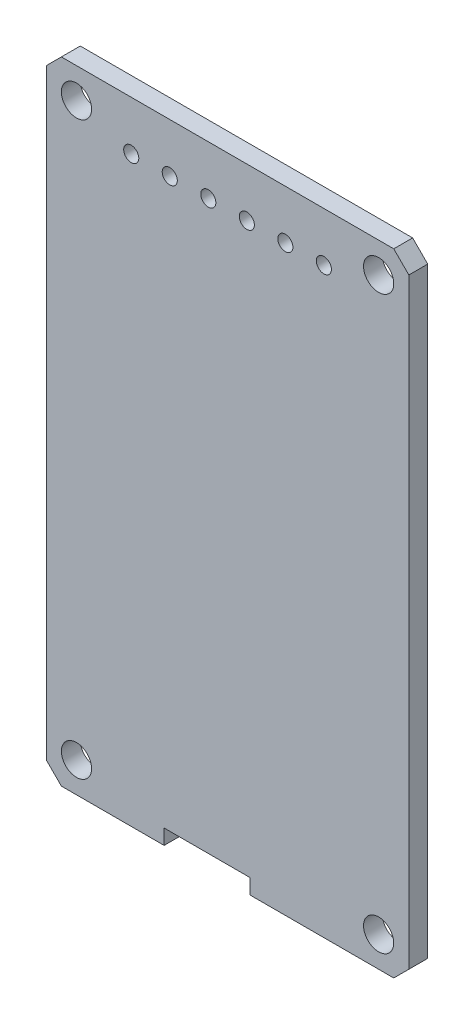
ISO-10303-21;
HEADER;
FILE_DESCRIPTION(('STEP AP214'),'2;1');
FILE_NAME('part.step','',(''),(''),'','','');
FILE_SCHEMA(('AUTOMOTIVE_DESIGN { 1 0 10303 214 1 1 1 1 }'));
ENDSEC;
DATA;
#1=APPLICATION_CONTEXT('core data for automotive mechanical design processes');
#2=APPLICATION_PROTOCOL_DEFINITION('international standard','automotive_design',2000,#1);
#3=PRODUCT_CONTEXT('',#1,'mechanical');
#4=PRODUCT('Part','Part','',(#3));
#5=PRODUCT_RELATED_PRODUCT_CATEGORY('part','',(#4));
#6=PRODUCT_DEFINITION_FORMATION('','',#4);
#7=PRODUCT_DEFINITION_CONTEXT('part definition',#1,'design');
#8=PRODUCT_DEFINITION('design','',#6,#7);
#9=PRODUCT_DEFINITION_SHAPE('','',#8);
#10=(LENGTH_UNIT() NAMED_UNIT(*) SI_UNIT(.MILLI.,.METRE.));
#11=(NAMED_UNIT(*) PLANE_ANGLE_UNIT() SI_UNIT($,.RADIAN.));
#12=(NAMED_UNIT(*) SI_UNIT($,.STERADIAN.) SOLID_ANGLE_UNIT());
#13=UNCERTAINTY_MEASURE_WITH_UNIT(LENGTH_MEASURE(1.E-05),#10,'distance_accuracy_value','');
#14=(GEOMETRIC_REPRESENTATION_CONTEXT(3) GLOBAL_UNCERTAINTY_ASSIGNED_CONTEXT((#13)) GLOBAL_UNIT_ASSIGNED_CONTEXT((#10,
#11,#12)) REPRESENTATION_CONTEXT('',''));
#15=CARTESIAN_POINT('',(0.,0.,0.));
#16=DIRECTION('',(0.,0.,1.));
#17=DIRECTION('',(1.,0.,0.));
#18=AXIS2_PLACEMENT_3D('',#15,#16,#17);
#19=CARTESIAN_POINT('',(0.,0.,0.));
#20=DIRECTION('',(0.,0.,1.));
#21=DIRECTION('',(1.,0.,0.));
#22=AXIS2_PLACEMENT_3D('',#19,#20,#21);
#23=PLANE('',#22);
#24=CARTESIAN_POINT('',(10.,2.,0.));
#25=DIRECTION('',(0.,0.,1.));
#26=DIRECTION('',(1.,0.,0.));
#27=AXIS2_PLACEMENT_3D('',#24,#25,#26);
#28=CIRCLE('',#27,1.);
#29=CARTESIAN_POINT('',(11.,2.,0.));
#30=VERTEX_POINT('',#29);
#31=EDGE_CURVE('E157',#30,#30,#28,.T.);
#32=ORIENTED_EDGE('',*,*,#31,.T.);
#33=EDGE_LOOP('',(#32));
#34=FACE_BOUND('',#33,.T.);
#35=CARTESIAN_POINT('',(1.275,38.55,0.));
#36=DIRECTION('',(0.,0.,1.));
#37=DIRECTION('',(1.,0.,0.));
#38=AXIS2_PLACEMENT_3D('',#35,#36,#37);
#39=CIRCLE('',#38,0.5);
#40=CARTESIAN_POINT('',(1.775,38.55,0.));
#41=VERTEX_POINT('',#40);
#42=EDGE_CURVE('E161',#41,#41,#39,.T.);
#43=ORIENTED_EDGE('',*,*,#42,.T.);
#44=EDGE_LOOP('',(#43));
#45=FACE_BOUND('',#44,.T.);
#46=CARTESIAN_POINT('',(-1.275,38.55,0.));
#47=DIRECTION('',(0.,0.,-1.));
#48=DIRECTION('',(-1.,0.,0.));
#49=AXIS2_PLACEMENT_3D('',#46,#47,#48);
#50=CIRCLE('',#49,0.5);
#51=CARTESIAN_POINT('',(-1.775,38.55,0.));
#52=VERTEX_POINT('',#51);
#53=EDGE_CURVE('E164',#52,#52,#50,.F.);
#54=ORIENTED_EDGE('',*,*,#53,.T.);
#55=EDGE_LOOP('',(#54));
#56=FACE_BOUND('',#55,.T.);
#57=CARTESIAN_POINT('',(-10.,2.,0.));
#58=DIRECTION('',(0.,0.,-1.));
#59=DIRECTION('',(-1.,0.,0.));
#60=AXIS2_PLACEMENT_3D('',#57,#58,#59);
#61=CIRCLE('',#60,1.);
#62=CARTESIAN_POINT('',(-11.,2.,0.));
#63=VERTEX_POINT('',#62);
#64=EDGE_CURVE('E167',#63,#63,#61,.F.);
#65=ORIENTED_EDGE('',*,*,#64,.T.);
#66=EDGE_LOOP('',(#65));
#67=FACE_BOUND('',#66,.T.);
#68=CARTESIAN_POINT('',(-10.,39.8,0.));
#69=DIRECTION('',(0.,0.,-1.));
#70=DIRECTION('',(-1.,0.,0.));
#71=AXIS2_PLACEMENT_3D('',#68,#69,#70);
#72=CIRCLE('',#71,1.);
#73=CARTESIAN_POINT('',(-11.,39.8,0.));
#74=VERTEX_POINT('',#73);
#75=EDGE_CURVE('E170',#74,#74,#72,.F.);
#76=ORIENTED_EDGE('',*,*,#75,.T.);
#77=EDGE_LOOP('',(#76));
#78=FACE_BOUND('',#77,.T.);
#79=CARTESIAN_POINT('',(-3.825,38.55,0.));
#80=DIRECTION('',(0.,0.,-1.));
#81=DIRECTION('',(-1.,0.,0.));
#82=AXIS2_PLACEMENT_3D('',#79,#80,#81);
#83=CIRCLE('',#82,0.5);
#84=CARTESIAN_POINT('',(-4.325,38.55,0.));
#85=VERTEX_POINT('',#84);
#86=EDGE_CURVE('E173',#85,#85,#83,.F.);
#87=ORIENTED_EDGE('',*,*,#86,.T.);
#88=EDGE_LOOP('',(#87));
#89=FACE_BOUND('',#88,.T.);
#90=CARTESIAN_POINT('',(-6.375,38.55,0.));
#91=DIRECTION('',(0.,0.,-1.));
#92=DIRECTION('',(-1.,0.,0.));
#93=AXIS2_PLACEMENT_3D('',#90,#91,#92);
#94=CIRCLE('',#93,0.5);
#95=CARTESIAN_POINT('',(-6.875,38.55,0.));
#96=VERTEX_POINT('',#95);
#97=EDGE_CURVE('E176',#96,#96,#94,.F.);
#98=ORIENTED_EDGE('',*,*,#97,.T.);
#99=EDGE_LOOP('',(#98));
#100=FACE_BOUND('',#99,.T.);
#101=CARTESIAN_POINT('',(3.825,38.55,0.));
#102=DIRECTION('',(0.,0.,1.));
#103=DIRECTION('',(1.,0.,0.));
#104=AXIS2_PLACEMENT_3D('',#101,#102,#103);
#105=CIRCLE('',#104,0.5);
#106=CARTESIAN_POINT('',(4.325,38.55,0.));
#107=VERTEX_POINT('',#106);
#108=EDGE_CURVE('E179',#107,#107,#105,.T.);
#109=ORIENTED_EDGE('',*,*,#108,.T.);
#110=EDGE_LOOP('',(#109));
#111=FACE_BOUND('',#110,.T.);
#112=CARTESIAN_POINT('',(10.,39.8,0.));
#113=DIRECTION('',(0.,0.,1.));
#114=DIRECTION('',(1.,0.,0.));
#115=AXIS2_PLACEMENT_3D('',#112,#113,#114);
#116=CIRCLE('',#115,1.);
#117=CARTESIAN_POINT('',(11.,39.8,0.));
#118=VERTEX_POINT('',#117);
#119=EDGE_CURVE('E181',#118,#118,#116,.T.);
#120=ORIENTED_EDGE('',*,*,#119,.T.);
#121=EDGE_LOOP('',(#120));
#122=FACE_BOUND('',#121,.T.);
#123=CARTESIAN_POINT('',(6.375,38.55,0.));
#124=DIRECTION('',(0.,0.,1.));
#125=DIRECTION('',(1.,0.,0.));
#126=AXIS2_PLACEMENT_3D('',#123,#124,#125);
#127=CIRCLE('',#126,0.5);
#128=CARTESIAN_POINT('',(6.875,38.55,0.));
#129=VERTEX_POINT('',#128);
#130=EDGE_CURVE('E20',#129,#129,#127,.T.);
#131=ORIENTED_EDGE('',*,*,#130,.T.);
#132=EDGE_LOOP('',(#131));
#133=FACE_BOUND('',#132,.T.);
#134=DIRECTION('',(1.,0.,0.));
#135=VECTOR('',#134,1.);
#136=CARTESIAN_POINT('',(1.5,1.,0.));
#137=LINE('',#136,#135);
#138=CARTESIAN_POINT('',(-4.2,1.,0.));
#139=VERTEX_POINT('',#138);
#140=CARTESIAN_POINT('',(1.5,1.,0.));
#141=VERTEX_POINT('',#140);
#142=EDGE_CURVE('E196',#139,#141,#137,.T.);
#143=ORIENTED_EDGE('',*,*,#142,.F.);
#144=DIRECTION('',(0.,1.,0.));
#145=VECTOR('',#144,1.);
#146=CARTESIAN_POINT('',(-4.2,1.,0.));
#147=LINE('',#146,#145);
#148=CARTESIAN_POINT('',(-4.2,0.,0.));
#149=VERTEX_POINT('',#148);
#150=EDGE_CURVE('E201',#149,#139,#147,.T.);
#151=ORIENTED_EDGE('',*,*,#150,.F.);
#152=DIRECTION('',(1.,0.,0.));
#153=VECTOR('',#152,1.);
#154=CARTESIAN_POINT('',(0.,0.,0.));
#155=LINE('',#154,#153);
#156=CARTESIAN_POINT('',(-11.,0.,0.));
#157=VERTEX_POINT('',#156);
#158=EDGE_CURVE('E208',#149,#157,#155,.F.);
#159=ORIENTED_EDGE('',*,*,#158,.T.);
#160=DIRECTION('',(-0.707106781186548,0.707106781186548,0.));
#161=VECTOR('',#160,1.);
#162=CARTESIAN_POINT('',(-12.,1.,0.));
#163=LINE('',#162,#161);
#164=CARTESIAN_POINT('',(-12.,1.,0.));
#165=VERTEX_POINT('',#164);
#166=EDGE_CURVE('E212',#157,#165,#163,.T.);
#167=ORIENTED_EDGE('',*,*,#166,.T.);
#168=DIRECTION('',(0.,1.,0.));
#169=VECTOR('',#168,1.);
#170=CARTESIAN_POINT('',(-12.,0.,0.));
#171=LINE('',#170,#169);
#172=CARTESIAN_POINT('',(-12.,40.8,0.));
#173=VERTEX_POINT('',#172);
#174=EDGE_CURVE('E216',#165,#173,#171,.T.);
#175=ORIENTED_EDGE('',*,*,#174,.T.);
#176=DIRECTION('',(-0.707106781186548,-0.707106781186548,0.));
#177=VECTOR('',#176,1.);
#178=CARTESIAN_POINT('',(-12.,40.8,0.));
#179=LINE('',#178,#177);
#180=CARTESIAN_POINT('',(-11.,41.8,0.));
#181=VERTEX_POINT('',#180);
#182=EDGE_CURVE('E218',#181,#173,#179,.T.);
#183=ORIENTED_EDGE('',*,*,#182,.F.);
#184=DIRECTION('',(1.,0.,0.));
#185=VECTOR('',#184,1.);
#186=CARTESIAN_POINT('',(-12.,41.8,0.));
#187=LINE('',#186,#185);
#188=CARTESIAN_POINT('',(11.,41.8,0.));
#189=VERTEX_POINT('',#188);
#190=EDGE_CURVE('E226',#181,#189,#187,.T.);
#191=ORIENTED_EDGE('',*,*,#190,.T.);
#192=DIRECTION('',(0.707106781186548,-0.707106781186548,0.));
#193=VECTOR('',#192,1.);
#194=CARTESIAN_POINT('',(12.,40.8,0.));
#195=LINE('',#194,#193);
#196=CARTESIAN_POINT('',(12.,40.8,0.));
#197=VERTEX_POINT('',#196);
#198=EDGE_CURVE('E230',#189,#197,#195,.T.);
#199=ORIENTED_EDGE('',*,*,#198,.T.);
#200=DIRECTION('',(0.,1.,0.));
#201=VECTOR('',#200,1.);
#202=CARTESIAN_POINT('',(12.,0.,0.));
#203=LINE('',#202,#201);
#204=CARTESIAN_POINT('',(12.,1.,0.));
#205=VERTEX_POINT('',#204);
#206=EDGE_CURVE('E103',#205,#197,#203,.T.);
#207=ORIENTED_EDGE('',*,*,#206,.F.);
#208=DIRECTION('',(0.707106781186548,0.707106781186548,0.));
#209=VECTOR('',#208,1.);
#210=CARTESIAN_POINT('',(12.,1.,0.));
#211=LINE('',#210,#209);
#212=CARTESIAN_POINT('',(11.,0.,0.));
#213=VERTEX_POINT('',#212);
#214=EDGE_CURVE('E118',#213,#205,#211,.T.);
#215=ORIENTED_EDGE('',*,*,#214,.F.);
#216=DIRECTION('',(1.,0.,0.));
#217=VECTOR('',#216,1.);
#218=CARTESIAN_POINT('',(0.,0.,0.));
#219=LINE('',#218,#217);
#220=CARTESIAN_POINT('',(1.5,0.,0.));
#221=VERTEX_POINT('',#220);
#222=EDGE_CURVE('E108',#213,#221,#219,.F.);
#223=ORIENTED_EDGE('',*,*,#222,.T.);
#224=DIRECTION('',(0.,1.,0.));
#225=VECTOR('',#224,1.);
#226=CARTESIAN_POINT('',(1.5,0.,0.));
#227=LINE('',#226,#225);
#228=EDGE_CURVE('E186',#141,#221,#227,.F.);
#229=ORIENTED_EDGE('',*,*,#228,.F.);
#230=EDGE_LOOP('',(#143,#151,#159,#167,#175,#183,#191,#199,#207,#215,#223,#229));
#231=FACE_BOUND('',#230,.T.);
#232=ADVANCED_FACE('F17',(#34,#45,#56,#67,#78,#89,#100,#111,#122,#133,#231),#23,.F.);
#233=CARTESIAN_POINT('',(0.,0.,0.));
#234=DIRECTION('',(0.,1.,0.));
#235=DIRECTION('',(0.,0.,1.));
#236=AXIS2_PLACEMENT_3D('',#233,#234,#235);
#237=PLANE('',#236);
#238=ORIENTED_EDGE('',*,*,#222,.F.);
#239=DIRECTION('',(0.,0.,1.));
#240=VECTOR('',#239,1.);
#241=CARTESIAN_POINT('',(11.,0.,-0.25));
#242=LINE('',#241,#240);
#243=CARTESIAN_POINT('',(11.,0.,1.25));
#244=VERTEX_POINT('',#243);
#245=EDGE_CURVE('E111',#244,#213,#242,.F.);
#246=ORIENTED_EDGE('',*,*,#245,.F.);
#247=DIRECTION('',(1.,0.,0.));
#248=VECTOR('',#247,1.);
#249=CARTESIAN_POINT('',(0.,0.,1.25));
#250=LINE('',#249,#248);
#251=CARTESIAN_POINT('',(1.5,0.,1.25));
#252=VERTEX_POINT('',#251);
#253=EDGE_CURVE('E160',#252,#244,#250,.T.);
#254=ORIENTED_EDGE('',*,*,#253,.F.);
#255=DIRECTION('',(0.,0.,1.));
#256=VECTOR('',#255,1.);
#257=CARTESIAN_POINT('',(1.5,0.,1.25));
#258=LINE('',#257,#256);
#259=EDGE_CURVE('E114',#221,#252,#258,.T.);
#260=ORIENTED_EDGE('',*,*,#259,.F.);
#261=EDGE_LOOP('',(#238,#246,#254,#260));
#262=FACE_BOUND('',#261,.T.);
#263=ADVANCED_FACE('F109',(#262),#237,.F.);
#264=CARTESIAN_POINT('',(12.,1.,-0.25));
#265=DIRECTION('',(0.707106781186548,-0.707106781186548,0.));
#266=DIRECTION('',(0.707106781186548,0.707106781186548,0.));
#267=AXIS2_PLACEMENT_3D('',#264,#265,#266);
#268=PLANE('',#267);
#269=ORIENTED_EDGE('',*,*,#214,.T.);
#270=DIRECTION('',(0.,0.,-1.));
#271=VECTOR('',#270,1.);
#272=CARTESIAN_POINT('',(12.,1.,0.));
#273=LINE('',#272,#271);
#274=CARTESIAN_POINT('',(12.,1.,1.25));
#275=VERTEX_POINT('',#274);
#276=EDGE_CURVE('E232',#275,#205,#273,.T.);
#277=ORIENTED_EDGE('',*,*,#276,.F.);
#278=DIRECTION('',(0.707106781186548,0.707106781186547,0.));
#279=VECTOR('',#278,1.);
#280=CARTESIAN_POINT('',(11.,0.,1.25));
#281=LINE('',#280,#279);
#282=EDGE_CURVE('E125',#244,#275,#281,.T.);
#283=ORIENTED_EDGE('',*,*,#282,.F.);
#284=ORIENTED_EDGE('',*,*,#245,.T.);
#285=EDGE_LOOP('',(#269,#277,#283,#284));
#286=FACE_BOUND('',#285,.T.);
#287=ADVANCED_FACE('F123',(#286),#268,.T.);
#288=CARTESIAN_POINT('',(12.,0.,0.));
#289=DIRECTION('',(1.,0.,0.));
#290=DIRECTION('',(0.,0.,-1.));
#291=AXIS2_PLACEMENT_3D('',#288,#289,#290);
#292=PLANE('',#291);
#293=DIRECTION('',(0.,1.,0.));
#294=VECTOR('',#293,1.);
#295=CARTESIAN_POINT('',(12.,0.,1.25));
#296=LINE('',#295,#294);
#297=CARTESIAN_POINT('',(12.,40.8,1.25));
#298=VERTEX_POINT('',#297);
#299=EDGE_CURVE('E249',#275,#298,#296,.T.);
#300=ORIENTED_EDGE('',*,*,#299,.F.);
#301=ORIENTED_EDGE('',*,*,#276,.T.);
#302=ORIENTED_EDGE('',*,*,#206,.T.);
#303=DIRECTION('',(0.,0.,1.));
#304=VECTOR('',#303,1.);
#305=CARTESIAN_POINT('',(12.,40.8,-0.25));
#306=LINE('',#305,#304);
#307=EDGE_CURVE('E228',#197,#298,#306,.T.);
#308=ORIENTED_EDGE('',*,*,#307,.T.);
#309=EDGE_LOOP('',(#300,#301,#302,#308));
#310=FACE_BOUND('',#309,.T.);
#311=ADVANCED_FACE('F236',(#310),#292,.T.);
#312=CARTESIAN_POINT('',(12.,40.8,-0.25));
#313=DIRECTION('',(-0.707106781186548,-0.707106781186548,0.));
#314=DIRECTION('',(0.707106781186548,-0.707106781186548,0.));
#315=AXIS2_PLACEMENT_3D('',#312,#313,#314);
#316=PLANE('',#315);
#317=ORIENTED_EDGE('',*,*,#198,.F.);
#318=DIRECTION('',(0.,0.,-1.));
#319=VECTOR('',#318,1.);
#320=CARTESIAN_POINT('',(11.,41.8,0.));
#321=LINE('',#320,#319);
#322=CARTESIAN_POINT('',(11.,41.8,1.25));
#323=VERTEX_POINT('',#322);
#324=EDGE_CURVE('E224',#189,#323,#321,.F.);
#325=ORIENTED_EDGE('',*,*,#324,.T.);
#326=DIRECTION('',(-0.707106781186547,0.707106781186547,0.));
#327=VECTOR('',#326,1.);
#328=CARTESIAN_POINT('',(12.,40.8,1.25));
#329=LINE('',#328,#327);
#330=EDGE_CURVE('E243',#298,#323,#329,.T.);
#331=ORIENTED_EDGE('',*,*,#330,.F.);
#332=ORIENTED_EDGE('',*,*,#307,.F.);
#333=EDGE_LOOP('',(#317,#325,#331,#332));
#334=FACE_BOUND('',#333,.T.);
#335=ADVANCED_FACE('F240',(#334),#316,.F.);
#336=CARTESIAN_POINT('',(-12.,41.8,0.));
#337=DIRECTION('',(0.,-1.,0.));
#338=DIRECTION('',(0.,0.,-1.));
#339=AXIS2_PLACEMENT_3D('',#336,#337,#338);
#340=PLANE('',#339);
#341=DIRECTION('',(1.,0.,0.));
#342=VECTOR('',#341,1.);
#343=CARTESIAN_POINT('',(0.,41.8,1.25));
#344=LINE('',#343,#342);
#345=CARTESIAN_POINT('',(-11.,41.8,1.25));
#346=VERTEX_POINT('',#345);
#347=EDGE_CURVE('E248',#323,#346,#344,.F.);
#348=ORIENTED_EDGE('',*,*,#347,.F.);
#349=ORIENTED_EDGE('',*,*,#324,.F.);
#350=ORIENTED_EDGE('',*,*,#190,.F.);
#351=DIRECTION('',(0.,0.,1.));
#352=VECTOR('',#351,1.);
#353=CARTESIAN_POINT('',(-11.,41.8,-0.25));
#354=LINE('',#353,#352);
#355=EDGE_CURVE('E221',#346,#181,#354,.F.);
#356=ORIENTED_EDGE('',*,*,#355,.F.);
#357=EDGE_LOOP('',(#348,#349,#350,#356));
#358=FACE_BOUND('',#357,.T.);
#359=ADVANCED_FACE('F426',(#358),#340,.F.);
#360=CARTESIAN_POINT('',(-12.,40.8,-0.25));
#361=DIRECTION('',(-0.707106781186548,0.707106781186548,0.));
#362=DIRECTION('',(-0.707106781186548,-0.707106781186548,0.));
#363=AXIS2_PLACEMENT_3D('',#360,#361,#362);
#364=PLANE('',#363);
#365=ORIENTED_EDGE('',*,*,#182,.T.);
#366=DIRECTION('',(0.,0.,-1.));
#367=VECTOR('',#366,1.);
#368=CARTESIAN_POINT('',(-12.,40.8,0.));
#369=LINE('',#368,#367);
#370=CARTESIAN_POINT('',(-12.,40.8,1.25));
#371=VERTEX_POINT('',#370);
#372=EDGE_CURVE('E214',#173,#371,#369,.F.);
#373=ORIENTED_EDGE('',*,*,#372,.T.);
#374=DIRECTION('',(-0.707106781186547,-0.707106781186547,0.));
#375=VECTOR('',#374,1.);
#376=CARTESIAN_POINT('',(-11.,41.8,1.25));
#377=LINE('',#376,#375);
#378=EDGE_CURVE('E256',#346,#371,#377,.T.);
#379=ORIENTED_EDGE('',*,*,#378,.F.);
#380=ORIENTED_EDGE('',*,*,#355,.T.);
#381=EDGE_LOOP('',(#365,#373,#379,#380));
#382=FACE_BOUND('',#381,.T.);
#383=ADVANCED_FACE('F418',(#382),#364,.T.);
#384=CARTESIAN_POINT('',(-12.,0.,0.));
#385=DIRECTION('',(1.,0.,0.));
#386=DIRECTION('',(0.,0.,-1.));
#387=AXIS2_PLACEMENT_3D('',#384,#385,#386);
#388=PLANE('',#387);
#389=DIRECTION('',(0.,1.,0.));
#390=VECTOR('',#389,1.);
#391=CARTESIAN_POINT('',(-12.,0.,1.25));
#392=LINE('',#391,#390);
#393=CARTESIAN_POINT('',(-12.,1.,1.25));
#394=VERTEX_POINT('',#393);
#395=EDGE_CURVE('E259',#371,#394,#392,.F.);
#396=ORIENTED_EDGE('',*,*,#395,.F.);
#397=ORIENTED_EDGE('',*,*,#372,.F.);
#398=ORIENTED_EDGE('',*,*,#174,.F.);
#399=DIRECTION('',(0.,0.,1.));
#400=VECTOR('',#399,1.);
#401=CARTESIAN_POINT('',(-12.,1.,-0.25));
#402=LINE('',#401,#400);
#403=EDGE_CURVE('E210',#165,#394,#402,.T.);
#404=ORIENTED_EDGE('',*,*,#403,.T.);
#405=EDGE_LOOP('',(#396,#397,#398,#404));
#406=FACE_BOUND('',#405,.T.);
#407=ADVANCED_FACE('F410',(#406),#388,.F.);
#408=CARTESIAN_POINT('',(-12.,1.,-0.25));
#409=DIRECTION('',(0.707106781186548,0.707106781186548,0.));
#410=DIRECTION('',(-0.707106781186548,0.707106781186548,0.));
#411=AXIS2_PLACEMENT_3D('',#408,#409,#410);
#412=PLANE('',#411);
#413=ORIENTED_EDGE('',*,*,#166,.F.);
#414=DIRECTION('',(0.,0.,1.));
#415=VECTOR('',#414,1.);
#416=CARTESIAN_POINT('',(-11.,0.,0.));
#417=LINE('',#416,#415);
#418=CARTESIAN_POINT('',(-11.,0.,1.25));
#419=VERTEX_POINT('',#418);
#420=EDGE_CURVE('E206',#157,#419,#417,.T.);
#421=ORIENTED_EDGE('',*,*,#420,.T.);
#422=DIRECTION('',(0.707106781186548,-0.707106781186547,0.));
#423=VECTOR('',#422,1.);
#424=CARTESIAN_POINT('',(-12.,1.,1.25));
#425=LINE('',#424,#423);
#426=EDGE_CURVE('E262',#394,#419,#425,.T.);
#427=ORIENTED_EDGE('',*,*,#426,.F.);
#428=ORIENTED_EDGE('',*,*,#403,.F.);
#429=EDGE_LOOP('',(#413,#421,#427,#428));
#430=FACE_BOUND('',#429,.T.);
#431=ADVANCED_FACE('F402',(#430),#412,.F.);
#432=CARTESIAN_POINT('',(0.,0.,0.));
#433=DIRECTION('',(0.,1.,0.));
#434=DIRECTION('',(0.,0.,1.));
#435=AXIS2_PLACEMENT_3D('',#432,#433,#434);
#436=PLANE('',#435);
#437=DIRECTION('',(1.,0.,0.));
#438=VECTOR('',#437,1.);
#439=CARTESIAN_POINT('',(0.,0.,1.25));
#440=LINE('',#439,#438);
#441=CARTESIAN_POINT('',(-4.2,0.,1.25));
#442=VERTEX_POINT('',#441);
#443=EDGE_CURVE('E265',#419,#442,#440,.T.);
#444=ORIENTED_EDGE('',*,*,#443,.F.);
#445=ORIENTED_EDGE('',*,*,#420,.F.);
#446=ORIENTED_EDGE('',*,*,#158,.F.);
#447=DIRECTION('',(0.,0.,-1.));
#448=VECTOR('',#447,1.);
#449=CARTESIAN_POINT('',(-4.2,0.,1.25));
#450=LINE('',#449,#448);
#451=EDGE_CURVE('E203',#442,#149,#450,.T.);
#452=ORIENTED_EDGE('',*,*,#451,.F.);
#453=EDGE_LOOP('',(#444,#445,#446,#452));
#454=FACE_BOUND('',#453,.T.);
#455=ADVANCED_FACE('F394',(#454),#436,.F.);
#456=CARTESIAN_POINT('',(-4.2,1.,1.25));
#457=DIRECTION('',(1.,0.,0.));
#458=DIRECTION('',(0.,0.,-1.));
#459=AXIS2_PLACEMENT_3D('',#456,#457,#458);
#460=PLANE('',#459);
#461=ORIENTED_EDGE('',*,*,#451,.T.);
#462=ORIENTED_EDGE('',*,*,#150,.T.);
#463=DIRECTION('',(0.,0.,-1.));
#464=VECTOR('',#463,1.);
#465=CARTESIAN_POINT('',(-4.2,1.,1.25));
#466=LINE('',#465,#464);
#467=CARTESIAN_POINT('',(-4.2,1.,1.25));
#468=VERTEX_POINT('',#467);
#469=EDGE_CURVE('E198',#468,#139,#466,.T.);
#470=ORIENTED_EDGE('',*,*,#469,.F.);
#471=DIRECTION('',(0.,1.,0.));
#472=VECTOR('',#471,1.);
#473=CARTESIAN_POINT('',(-4.2,0.,1.25));
#474=LINE('',#473,#472);
#475=EDGE_CURVE('E268',#442,#468,#474,.T.);
#476=ORIENTED_EDGE('',*,*,#475,.F.);
#477=EDGE_LOOP('',(#461,#462,#470,#476));
#478=FACE_BOUND('',#477,.T.);
#479=ADVANCED_FACE('F287',(#478),#460,.T.);
#480=CARTESIAN_POINT('',(1.5,1.,1.25));
#481=DIRECTION('',(0.,-1.,0.));
#482=DIRECTION('',(0.,0.,-1.));
#483=AXIS2_PLACEMENT_3D('',#480,#481,#482);
#484=PLANE('',#483);
#485=ORIENTED_EDGE('',*,*,#469,.T.);
#486=ORIENTED_EDGE('',*,*,#142,.T.);
#487=DIRECTION('',(0.,0.,1.));
#488=VECTOR('',#487,1.);
#489=CARTESIAN_POINT('',(1.5,1.,1.25));
#490=LINE('',#489,#488);
#491=CARTESIAN_POINT('',(1.5,1.,1.25));
#492=VERTEX_POINT('',#491);
#493=EDGE_CURVE('E35',#492,#141,#490,.F.);
#494=ORIENTED_EDGE('',*,*,#493,.F.);
#495=DIRECTION('',(1.,0.,0.));
#496=VECTOR('',#495,1.);
#497=CARTESIAN_POINT('',(0.,1.,1.25));
#498=LINE('',#497,#496);
#499=EDGE_CURVE('E271',#468,#492,#498,.T.);
#500=ORIENTED_EDGE('',*,*,#499,.F.);
#501=EDGE_LOOP('',(#485,#486,#494,#500));
#502=FACE_BOUND('',#501,.T.);
#503=ADVANCED_FACE('F277',(#502),#484,.T.);
#504=CARTESIAN_POINT('',(1.5,0.,1.25));
#505=DIRECTION('',(-1.,0.,0.));
#506=DIRECTION('',(0.,0.,1.));
#507=AXIS2_PLACEMENT_3D('',#504,#505,#506);
#508=PLANE('',#507);
#509=ORIENTED_EDGE('',*,*,#493,.T.);
#510=ORIENTED_EDGE('',*,*,#228,.T.);
#511=ORIENTED_EDGE('',*,*,#259,.T.);
#512=DIRECTION('',(0.,1.,0.));
#513=VECTOR('',#512,1.);
#514=CARTESIAN_POINT('',(1.5,0.,1.25));
#515=LINE('',#514,#513);
#516=EDGE_CURVE('E156',#492,#252,#515,.F.);
#517=ORIENTED_EDGE('',*,*,#516,.F.);
#518=EDGE_LOOP('',(#509,#510,#511,#517));
#519=FACE_BOUND('',#518,.T.);
#520=ADVANCED_FACE('F274',(#519),#508,.T.);
#521=CARTESIAN_POINT('',(6.375,38.55,1.25));
#522=DIRECTION('',(0.,0.,1.));
#523=DIRECTION('',(1.,0.,0.));
#524=AXIS2_PLACEMENT_3D('',#521,#522,#523);
#525=CYLINDRICAL_SURFACE('',#524,0.5);
#526=ORIENTED_EDGE('',*,*,#130,.F.);
#527=EDGE_LOOP('',(#526));
#528=FACE_BOUND('',#527,.T.);
#529=CARTESIAN_POINT('',(6.375,38.55,1.25));
#530=DIRECTION('',(0.,0.,1.));
#531=DIRECTION('',(1.,0.,0.));
#532=AXIS2_PLACEMENT_3D('',#529,#530,#531);
#533=CIRCLE('',#532,0.5);
#534=CARTESIAN_POINT('',(6.875,38.55,1.25));
#535=VERTEX_POINT('',#534);
#536=EDGE_CURVE('E153',#535,#535,#533,.F.);
#537=ORIENTED_EDGE('',*,*,#536,.F.);
#538=EDGE_LOOP('',(#537));
#539=FACE_BOUND('',#538,.T.);
#540=ADVANCED_FACE('F276',(#528,#539),#525,.F.);
#541=CARTESIAN_POINT('',(10.,39.8,1.25));
#542=DIRECTION('',(0.,0.,1.));
#543=DIRECTION('',(1.,0.,0.));
#544=AXIS2_PLACEMENT_3D('',#541,#542,#543);
#545=CYLINDRICAL_SURFACE('',#544,1.);
#546=ORIENTED_EDGE('',*,*,#119,.F.);
#547=EDGE_LOOP('',(#546));
#548=FACE_BOUND('',#547,.T.);
#549=CARTESIAN_POINT('',(10.,39.8,1.25));
#550=DIRECTION('',(0.,0.,1.));
#551=DIRECTION('',(1.,0.,0.));
#552=AXIS2_PLACEMENT_3D('',#549,#550,#551);
#553=CIRCLE('',#552,1.);
#554=CARTESIAN_POINT('',(11.,39.8,1.25));
#555=VERTEX_POINT('',#554);
#556=EDGE_CURVE('E150',#555,#555,#553,.F.);
#557=ORIENTED_EDGE('',*,*,#556,.F.);
#558=EDGE_LOOP('',(#557));
#559=FACE_BOUND('',#558,.T.);
#560=ADVANCED_FACE('F284',(#548,#559),#545,.F.);
#561=CARTESIAN_POINT('',(3.825,38.55,1.25));
#562=DIRECTION('',(0.,0.,1.));
#563=DIRECTION('',(1.,0.,0.));
#564=AXIS2_PLACEMENT_3D('',#561,#562,#563);
#565=CYLINDRICAL_SURFACE('',#564,0.5);
#566=ORIENTED_EDGE('',*,*,#108,.F.);
#567=EDGE_LOOP('',(#566));
#568=FACE_BOUND('',#567,.T.);
#569=CARTESIAN_POINT('',(3.825,38.55,1.25));
#570=DIRECTION('',(0.,0.,1.));
#571=DIRECTION('',(1.,0.,0.));
#572=AXIS2_PLACEMENT_3D('',#569,#570,#571);
#573=CIRCLE('',#572,0.5);
#574=CARTESIAN_POINT('',(4.325,38.55,1.25));
#575=VERTEX_POINT('',#574);
#576=EDGE_CURVE('E147',#575,#575,#573,.F.);
#577=ORIENTED_EDGE('',*,*,#576,.F.);
#578=EDGE_LOOP('',(#577));
#579=FACE_BOUND('',#578,.T.);
#580=ADVANCED_FACE('F323',(#568,#579),#565,.F.);
#581=CARTESIAN_POINT('',(-6.375,38.55,1.25));
#582=DIRECTION('',(0.,0.,-1.));
#583=DIRECTION('',(-1.,0.,0.));
#584=AXIS2_PLACEMENT_3D('',#581,#582,#583);
#585=CYLINDRICAL_SURFACE('',#584,0.5);
#586=ORIENTED_EDGE('',*,*,#97,.F.);
#587=EDGE_LOOP('',(#586));
#588=FACE_BOUND('',#587,.T.);
#589=CARTESIAN_POINT('',(-6.375,38.55,1.25));
#590=DIRECTION('',(0.,0.,-1.));
#591=DIRECTION('',(-1.,0.,0.));
#592=AXIS2_PLACEMENT_3D('',#589,#590,#591);
#593=CIRCLE('',#592,0.5);
#594=CARTESIAN_POINT('',(-6.875,38.55,1.25));
#595=VERTEX_POINT('',#594);
#596=EDGE_CURVE('E144',#595,#595,#593,.T.);
#597=ORIENTED_EDGE('',*,*,#596,.F.);
#598=EDGE_LOOP('',(#597));
#599=FACE_BOUND('',#598,.T.);
#600=ADVANCED_FACE('F319',(#588,#599),#585,.F.);
#601=CARTESIAN_POINT('',(-3.825,38.55,1.25));
#602=DIRECTION('',(0.,0.,-1.));
#603=DIRECTION('',(-1.,0.,0.));
#604=AXIS2_PLACEMENT_3D('',#601,#602,#603);
#605=CYLINDRICAL_SURFACE('',#604,0.5);
#606=ORIENTED_EDGE('',*,*,#86,.F.);
#607=EDGE_LOOP('',(#606));
#608=FACE_BOUND('',#607,.T.);
#609=CARTESIAN_POINT('',(-3.825,38.55,1.25));
#610=DIRECTION('',(0.,0.,-1.));
#611=DIRECTION('',(-1.,0.,0.));
#612=AXIS2_PLACEMENT_3D('',#609,#610,#611);
#613=CIRCLE('',#612,0.5);
#614=CARTESIAN_POINT('',(-4.325,38.55,1.25));
#615=VERTEX_POINT('',#614);
#616=EDGE_CURVE('E141',#615,#615,#613,.T.);
#617=ORIENTED_EDGE('',*,*,#616,.F.);
#618=EDGE_LOOP('',(#617));
#619=FACE_BOUND('',#618,.T.);
#620=ADVANCED_FACE('F315',(#608,#619),#605,.F.);
#621=CARTESIAN_POINT('',(-10.,39.8,1.25));
#622=DIRECTION('',(0.,0.,-1.));
#623=DIRECTION('',(-1.,0.,0.));
#624=AXIS2_PLACEMENT_3D('',#621,#622,#623);
#625=CYLINDRICAL_SURFACE('',#624,1.);
#626=ORIENTED_EDGE('',*,*,#75,.F.);
#627=EDGE_LOOP('',(#626));
#628=FACE_BOUND('',#627,.T.);
#629=CARTESIAN_POINT('',(-10.,39.8,1.25));
#630=DIRECTION('',(0.,0.,-1.));
#631=DIRECTION('',(-1.,0.,0.));
#632=AXIS2_PLACEMENT_3D('',#629,#630,#631);
#633=CIRCLE('',#632,1.);
#634=CARTESIAN_POINT('',(-11.,39.8,1.25));
#635=VERTEX_POINT('',#634);
#636=EDGE_CURVE('E138',#635,#635,#633,.T.);
#637=ORIENTED_EDGE('',*,*,#636,.F.);
#638=EDGE_LOOP('',(#637));
#639=FACE_BOUND('',#638,.T.);
#640=ADVANCED_FACE('F311',(#628,#639),#625,.F.);
#641=CARTESIAN_POINT('',(-10.,2.,1.25));
#642=DIRECTION('',(0.,0.,-1.));
#643=DIRECTION('',(-1.,0.,0.));
#644=AXIS2_PLACEMENT_3D('',#641,#642,#643);
#645=CYLINDRICAL_SURFACE('',#644,1.);
#646=ORIENTED_EDGE('',*,*,#64,.F.);
#647=EDGE_LOOP('',(#646));
#648=FACE_BOUND('',#647,.T.);
#649=CARTESIAN_POINT('',(-10.,2.,1.25));
#650=DIRECTION('',(0.,0.,-1.));
#651=DIRECTION('',(-1.,0.,0.));
#652=AXIS2_PLACEMENT_3D('',#649,#650,#651);
#653=CIRCLE('',#652,1.);
#654=CARTESIAN_POINT('',(-11.,2.,1.25));
#655=VERTEX_POINT('',#654);
#656=EDGE_CURVE('E135',#655,#655,#653,.T.);
#657=ORIENTED_EDGE('',*,*,#656,.F.);
#658=EDGE_LOOP('',(#657));
#659=FACE_BOUND('',#658,.T.);
#660=ADVANCED_FACE('F307',(#648,#659),#645,.F.);
#661=CARTESIAN_POINT('',(-1.275,38.55,1.25));
#662=DIRECTION('',(0.,0.,-1.));
#663=DIRECTION('',(-1.,0.,0.));
#664=AXIS2_PLACEMENT_3D('',#661,#662,#663);
#665=CYLINDRICAL_SURFACE('',#664,0.5);
#666=ORIENTED_EDGE('',*,*,#53,.F.);
#667=EDGE_LOOP('',(#666));
#668=FACE_BOUND('',#667,.T.);
#669=CARTESIAN_POINT('',(-1.275,38.55,1.25));
#670=DIRECTION('',(0.,0.,-1.));
#671=DIRECTION('',(-1.,0.,0.));
#672=AXIS2_PLACEMENT_3D('',#669,#670,#671);
#673=CIRCLE('',#672,0.5);
#674=CARTESIAN_POINT('',(-1.775,38.55,1.25));
#675=VERTEX_POINT('',#674);
#676=EDGE_CURVE('E132',#675,#675,#673,.T.);
#677=ORIENTED_EDGE('',*,*,#676,.F.);
#678=EDGE_LOOP('',(#677));
#679=FACE_BOUND('',#678,.T.);
#680=ADVANCED_FACE('F303',(#668,#679),#665,.F.);
#681=CARTESIAN_POINT('',(1.275,38.55,1.25));
#682=DIRECTION('',(0.,0.,1.));
#683=DIRECTION('',(1.,0.,0.));
#684=AXIS2_PLACEMENT_3D('',#681,#682,#683);
#685=CYLINDRICAL_SURFACE('',#684,0.5);
#686=ORIENTED_EDGE('',*,*,#42,.F.);
#687=EDGE_LOOP('',(#686));
#688=FACE_BOUND('',#687,.T.);
#689=CARTESIAN_POINT('',(1.275,38.55,1.25));
#690=DIRECTION('',(0.,0.,1.));
#691=DIRECTION('',(1.,0.,0.));
#692=AXIS2_PLACEMENT_3D('',#689,#690,#691);
#693=CIRCLE('',#692,0.5);
#694=CARTESIAN_POINT('',(1.775,38.55,1.25));
#695=VERTEX_POINT('',#694);
#696=EDGE_CURVE('E26',#695,#695,#693,.F.);
#697=ORIENTED_EDGE('',*,*,#696,.F.);
#698=EDGE_LOOP('',(#697));
#699=FACE_BOUND('',#698,.T.);
#700=ADVANCED_FACE('F296',(#688,#699),#685,.F.);
#701=CARTESIAN_POINT('',(10.,2.,1.25));
#702=DIRECTION('',(0.,0.,1.));
#703=DIRECTION('',(1.,0.,0.));
#704=AXIS2_PLACEMENT_3D('',#701,#702,#703);
#705=CYLINDRICAL_SURFACE('',#704,1.);
#706=ORIENTED_EDGE('',*,*,#31,.F.);
#707=EDGE_LOOP('',(#706));
#708=FACE_BOUND('',#707,.T.);
#709=CARTESIAN_POINT('',(10.,2.,1.25));
#710=DIRECTION('',(0.,0.,1.));
#711=DIRECTION('',(1.,0.,0.));
#712=AXIS2_PLACEMENT_3D('',#709,#710,#711);
#713=CIRCLE('',#712,1.);
#714=CARTESIAN_POINT('',(11.,2.,1.25));
#715=VERTEX_POINT('',#714);
#716=EDGE_CURVE('E11',#715,#715,#713,.F.);
#717=ORIENTED_EDGE('',*,*,#716,.F.);
#718=EDGE_LOOP('',(#717));
#719=FACE_BOUND('',#718,.T.);
#720=ADVANCED_FACE('F290',(#708,#719),#705,.F.);
#721=CARTESIAN_POINT('',(0.,0.,1.25));
#722=DIRECTION('',(0.,0.,1.));
#723=DIRECTION('',(1.,0.,0.));
#724=AXIS2_PLACEMENT_3D('',#721,#722,#723);
#725=PLANE('',#724);
#726=ORIENTED_EDGE('',*,*,#716,.T.);
#727=EDGE_LOOP('',(#726));
#728=FACE_BOUND('',#727,.T.);
#729=ORIENTED_EDGE('',*,*,#696,.T.);
#730=EDGE_LOOP('',(#729));
#731=FACE_BOUND('',#730,.T.);
#732=ORIENTED_EDGE('',*,*,#676,.T.);
#733=EDGE_LOOP('',(#732));
#734=FACE_BOUND('',#733,.T.);
#735=ORIENTED_EDGE('',*,*,#656,.T.);
#736=EDGE_LOOP('',(#735));
#737=FACE_BOUND('',#736,.T.);
#738=ORIENTED_EDGE('',*,*,#636,.T.);
#739=EDGE_LOOP('',(#738));
#740=FACE_BOUND('',#739,.T.);
#741=ORIENTED_EDGE('',*,*,#616,.T.);
#742=EDGE_LOOP('',(#741));
#743=FACE_BOUND('',#742,.T.);
#744=ORIENTED_EDGE('',*,*,#596,.T.);
#745=EDGE_LOOP('',(#744));
#746=FACE_BOUND('',#745,.T.);
#747=ORIENTED_EDGE('',*,*,#576,.T.);
#748=EDGE_LOOP('',(#747));
#749=FACE_BOUND('',#748,.T.);
#750=ORIENTED_EDGE('',*,*,#556,.T.);
#751=EDGE_LOOP('',(#750));
#752=FACE_BOUND('',#751,.T.);
#753=ORIENTED_EDGE('',*,*,#536,.T.);
#754=EDGE_LOOP('',(#753));
#755=FACE_BOUND('',#754,.T.);
#756=ORIENTED_EDGE('',*,*,#499,.T.);
#757=ORIENTED_EDGE('',*,*,#516,.T.);
#758=ORIENTED_EDGE('',*,*,#253,.T.);
#759=ORIENTED_EDGE('',*,*,#282,.T.);
#760=ORIENTED_EDGE('',*,*,#299,.T.);
#761=ORIENTED_EDGE('',*,*,#330,.T.);
#762=ORIENTED_EDGE('',*,*,#347,.T.);
#763=ORIENTED_EDGE('',*,*,#378,.T.);
#764=ORIENTED_EDGE('',*,*,#395,.T.);
#765=ORIENTED_EDGE('',*,*,#426,.T.);
#766=ORIENTED_EDGE('',*,*,#443,.T.);
#767=ORIENTED_EDGE('',*,*,#475,.T.);
#768=EDGE_LOOP('',(#756,#757,#758,#759,#760,#761,#762,#763,#764,#765,#766,#767));
#769=FACE_BOUND('',#768,.T.);
#770=ADVANCED_FACE('F252',(#728,#731,#734,#737,#740,#743,#746,#749,#752,#755,#769),#725,.T.);
#771=CLOSED_SHELL('',(#232,#263,#287,#311,#335,#359,#383,#407,#431,#455,#479,#503,#520,#540,
#560,#580,#600,#620,#640,#660,#680,#700,#720,#770));
#772=MANIFOLD_SOLID_BREP('B1',#771);
#773=ADVANCED_BREP_SHAPE_REPRESENTATION('',(#18,#772),#14);
#774=SHAPE_DEFINITION_REPRESENTATION(#9,#773);
ENDSEC;
END-ISO-10303-21;
